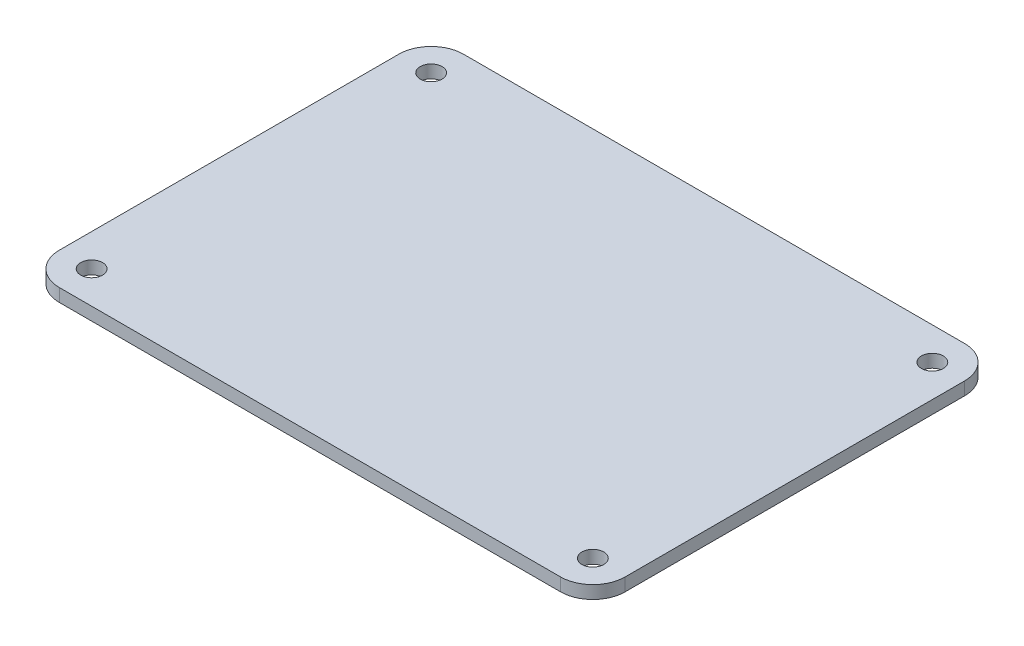
ISO-10303-21;
HEADER;
FILE_DESCRIPTION(('STEP AP214'),'2;1');
FILE_NAME('part.step','',(''),(''),'','','');
FILE_SCHEMA(('AUTOMOTIVE_DESIGN { 1 0 10303 214 1 1 1 1 }'));
ENDSEC;
DATA;
#1=APPLICATION_CONTEXT('core data for automotive mechanical design processes');
#2=APPLICATION_PROTOCOL_DEFINITION('international standard','automotive_design',2000,#1);
#3=PRODUCT_CONTEXT('',#1,'mechanical');
#4=PRODUCT('Part','Part','',(#3));
#5=PRODUCT_RELATED_PRODUCT_CATEGORY('part','',(#4));
#6=PRODUCT_DEFINITION_FORMATION('','',#4);
#7=PRODUCT_DEFINITION_CONTEXT('part definition',#1,'design');
#8=PRODUCT_DEFINITION('design','',#6,#7);
#9=PRODUCT_DEFINITION_SHAPE('','',#8);
#10=(LENGTH_UNIT() NAMED_UNIT(*) SI_UNIT(.MILLI.,.METRE.));
#11=(NAMED_UNIT(*) PLANE_ANGLE_UNIT() SI_UNIT($,.RADIAN.));
#12=(NAMED_UNIT(*) SI_UNIT($,.STERADIAN.) SOLID_ANGLE_UNIT());
#13=UNCERTAINTY_MEASURE_WITH_UNIT(LENGTH_MEASURE(1.E-05),#10,'distance_accuracy_value','');
#14=(GEOMETRIC_REPRESENTATION_CONTEXT(3) GLOBAL_UNCERTAINTY_ASSIGNED_CONTEXT((#13)) GLOBAL_UNIT_ASSIGNED_CONTEXT((#10,
#11,#12)) REPRESENTATION_CONTEXT('',''));
#15=CARTESIAN_POINT('',(0.,0.,0.));
#16=DIRECTION('',(0.,0.,1.));
#17=DIRECTION('',(1.,0.,0.));
#18=AXIS2_PLACEMENT_3D('',#15,#16,#17);
#19=CARTESIAN_POINT('',(35.,1.6,25.));
#20=DIRECTION('',(-1.,0.,0.));
#21=DIRECTION('',(0.,0.,1.));
#22=AXIS2_PLACEMENT_3D('',#19,#20,#21);
#23=PLANE('',#22);
#24=DIRECTION('',(0.,0.,-1.));
#25=VECTOR('',#24,1.);
#26=CARTESIAN_POINT('',(35.,0.,25.));
#27=LINE('',#26,#25);
#28=CARTESIAN_POINT('',(35.,0.,21.));
#29=VERTEX_POINT('',#28);
#30=CARTESIAN_POINT('',(35.,0.,-21.));
#31=VERTEX_POINT('',#30);
#32=EDGE_CURVE('E126',#29,#31,#27,.T.);
#33=ORIENTED_EDGE('',*,*,#32,.T.);
#34=DIRECTION('',(0.,-1.,0.));
#35=VECTOR('',#34,1.);
#36=CARTESIAN_POINT('',(35.,1.6,-21.));
#37=LINE('',#36,#35);
#38=CARTESIAN_POINT('',(35.,1.6,-21.));
#39=VERTEX_POINT('',#38);
#40=EDGE_CURVE('E104',#31,#39,#37,.F.);
#41=ORIENTED_EDGE('',*,*,#40,.T.);
#42=DIRECTION('',(0.,0.,-1.));
#43=VECTOR('',#42,1.);
#44=CARTESIAN_POINT('',(35.,1.6,25.));
#45=LINE('',#44,#43);
#46=CARTESIAN_POINT('',(35.,1.6,21.));
#47=VERTEX_POINT('',#46);
#48=EDGE_CURVE('E136',#47,#39,#45,.T.);
#49=ORIENTED_EDGE('',*,*,#48,.F.);
#50=DIRECTION('',(0.,-1.,0.));
#51=VECTOR('',#50,1.);
#52=CARTESIAN_POINT('',(35.,1.6,21.));
#53=LINE('',#52,#51);
#54=EDGE_CURVE('E109',#47,#29,#53,.T.);
#55=ORIENTED_EDGE('',*,*,#54,.T.);
#56=EDGE_LOOP('',(#33,#41,#49,#55));
#57=FACE_BOUND('',#56,.T.);
#58=ADVANCED_FACE('F33',(#57),#23,.F.);
#59=CARTESIAN_POINT('',(-35.,1.6,-25.));
#60=DIRECTION('',(0.,0.,1.));
#61=DIRECTION('',(1.,0.,0.));
#62=AXIS2_PLACEMENT_3D('',#59,#60,#61);
#63=PLANE('',#62);
#64=DIRECTION('',(-1.,0.,0.));
#65=VECTOR('',#64,1.);
#66=CARTESIAN_POINT('',(-35.,1.6,-25.));
#67=LINE('',#66,#65);
#68=CARTESIAN_POINT('',(31.,1.6,-25.));
#69=VERTEX_POINT('',#68);
#70=CARTESIAN_POINT('',(-31.,1.6,-25.));
#71=VERTEX_POINT('',#70);
#72=EDGE_CURVE('E119',#69,#71,#67,.T.);
#73=ORIENTED_EDGE('',*,*,#72,.F.);
#74=DIRECTION('',(0.,-1.,0.));
#75=VECTOR('',#74,1.);
#76=CARTESIAN_POINT('',(31.,1.6,-25.));
#77=LINE('',#76,#75);
#78=CARTESIAN_POINT('',(31.,0.,-25.));
#79=VERTEX_POINT('',#78);
#80=EDGE_CURVE('E103',#69,#79,#77,.T.);
#81=ORIENTED_EDGE('',*,*,#80,.T.);
#82=DIRECTION('',(-1.,0.,0.));
#83=VECTOR('',#82,1.);
#84=CARTESIAN_POINT('',(-35.,0.,-25.));
#85=LINE('',#84,#83);
#86=CARTESIAN_POINT('',(-31.,0.,-25.));
#87=VERTEX_POINT('',#86);
#88=EDGE_CURVE('E116',#79,#87,#85,.T.);
#89=ORIENTED_EDGE('',*,*,#88,.T.);
#90=DIRECTION('',(0.,-1.,0.));
#91=VECTOR('',#90,1.);
#92=CARTESIAN_POINT('',(-31.,1.6,-25.));
#93=LINE('',#92,#91);
#94=EDGE_CURVE('E121',#87,#71,#93,.F.);
#95=ORIENTED_EDGE('',*,*,#94,.T.);
#96=EDGE_LOOP('',(#73,#81,#89,#95));
#97=FACE_BOUND('',#96,.T.);
#98=ADVANCED_FACE('F115',(#97),#63,.F.);
#99=CARTESIAN_POINT('',(-35.,1.6,25.));
#100=DIRECTION('',(1.,0.,0.));
#101=DIRECTION('',(0.,0.,-1.));
#102=AXIS2_PLACEMENT_3D('',#99,#100,#101);
#103=PLANE('',#102);
#104=DIRECTION('',(0.,0.,1.));
#105=VECTOR('',#104,1.);
#106=CARTESIAN_POINT('',(-35.,0.,25.));
#107=LINE('',#106,#105);
#108=CARTESIAN_POINT('',(-35.,0.,-21.));
#109=VERTEX_POINT('',#108);
#110=CARTESIAN_POINT('',(-35.,0.,21.));
#111=VERTEX_POINT('',#110);
#112=EDGE_CURVE('E125',#109,#111,#107,.T.);
#113=ORIENTED_EDGE('',*,*,#112,.T.);
#114=DIRECTION('',(0.,-1.,0.));
#115=VECTOR('',#114,1.);
#116=CARTESIAN_POINT('',(-35.,1.6,21.));
#117=LINE('',#116,#115);
#118=CARTESIAN_POINT('',(-35.,1.6,21.));
#119=VERTEX_POINT('',#118);
#120=EDGE_CURVE('E11',#111,#119,#117,.F.);
#121=ORIENTED_EDGE('',*,*,#120,.T.);
#122=DIRECTION('',(0.,0.,1.));
#123=VECTOR('',#122,1.);
#124=CARTESIAN_POINT('',(-35.,1.6,25.));
#125=LINE('',#124,#123);
#126=CARTESIAN_POINT('',(-35.,1.6,-21.));
#127=VERTEX_POINT('',#126);
#128=EDGE_CURVE('E162',#127,#119,#125,.T.);
#129=ORIENTED_EDGE('',*,*,#128,.F.);
#130=DIRECTION('',(0.,-1.,0.));
#131=VECTOR('',#130,1.);
#132=CARTESIAN_POINT('',(-35.,1.6,-21.));
#133=LINE('',#132,#131);
#134=EDGE_CURVE('E41',#127,#109,#133,.T.);
#135=ORIENTED_EDGE('',*,*,#134,.T.);
#136=EDGE_LOOP('',(#113,#121,#129,#135));
#137=FACE_BOUND('',#136,.T.);
#138=ADVANCED_FACE('F160',(#137),#103,.F.);
#139=CARTESIAN_POINT('',(-35.,1.6,25.));
#140=DIRECTION('',(0.,0.,-1.));
#141=DIRECTION('',(-1.,0.,0.));
#142=AXIS2_PLACEMENT_3D('',#139,#140,#141);
#143=PLANE('',#142);
#144=DIRECTION('',(1.,0.,0.));
#145=VECTOR('',#144,1.);
#146=CARTESIAN_POINT('',(-35.,0.,25.));
#147=LINE('',#146,#145);
#148=CARTESIAN_POINT('',(-31.,0.,25.));
#149=VERTEX_POINT('',#148);
#150=CARTESIAN_POINT('',(31.,0.,25.));
#151=VERTEX_POINT('',#150);
#152=EDGE_CURVE('E129',#149,#151,#147,.T.);
#153=ORIENTED_EDGE('',*,*,#152,.T.);
#154=DIRECTION('',(0.,-1.,0.));
#155=VECTOR('',#154,1.);
#156=CARTESIAN_POINT('',(31.,1.6,25.));
#157=LINE('',#156,#155);
#158=CARTESIAN_POINT('',(31.,1.6,25.));
#159=VERTEX_POINT('',#158);
#160=EDGE_CURVE('E48',#151,#159,#157,.F.);
#161=ORIENTED_EDGE('',*,*,#160,.T.);
#162=DIRECTION('',(1.,0.,0.));
#163=VECTOR('',#162,1.);
#164=CARTESIAN_POINT('',(-35.,1.6,25.));
#165=LINE('',#164,#163);
#166=CARTESIAN_POINT('',(-31.,1.6,25.));
#167=VERTEX_POINT('',#166);
#168=EDGE_CURVE('E137',#167,#159,#165,.T.);
#169=ORIENTED_EDGE('',*,*,#168,.F.);
#170=DIRECTION('',(0.,-1.,0.));
#171=VECTOR('',#170,1.);
#172=CARTESIAN_POINT('',(-31.,1.6,25.));
#173=LINE('',#172,#171);
#174=EDGE_CURVE('E153',#167,#149,#173,.T.);
#175=ORIENTED_EDGE('',*,*,#174,.T.);
#176=EDGE_LOOP('',(#153,#161,#169,#175));
#177=FACE_BOUND('',#176,.T.);
#178=ADVANCED_FACE('F169',(#177),#143,.F.);
#179=CARTESIAN_POINT('',(0.,1.6,0.));
#180=DIRECTION('',(0.,-1.,0.));
#181=DIRECTION('',(0.,0.,-1.));
#182=AXIS2_PLACEMENT_3D('',#179,#180,#181);
#183=PLANE('',#182);
#184=CARTESIAN_POINT('',(-31.,1.6,21.));
#185=DIRECTION('',(0.,1.,0.));
#186=DIRECTION('',(0.,0.,1.));
#187=AXIS2_PLACEMENT_3D('',#184,#185,#186);
#188=CIRCLE('',#187,1.35);
#189=CARTESIAN_POINT('',(-31.,1.6,22.35));
#190=VERTEX_POINT('',#189);
#191=EDGE_CURVE('E182',#190,#190,#188,.T.);
#192=ORIENTED_EDGE('',*,*,#191,.F.);
#193=EDGE_LOOP('',(#192));
#194=FACE_BOUND('',#193,.T.);
#195=CARTESIAN_POINT('',(31.,1.6,21.));
#196=DIRECTION('',(0.,1.,0.));
#197=DIRECTION('',(0.,0.,1.));
#198=AXIS2_PLACEMENT_3D('',#195,#196,#197);
#199=CIRCLE('',#198,1.35);
#200=CARTESIAN_POINT('',(31.,1.6,22.35));
#201=VERTEX_POINT('',#200);
#202=EDGE_CURVE('E188',#201,#201,#199,.T.);
#203=ORIENTED_EDGE('',*,*,#202,.F.);
#204=EDGE_LOOP('',(#203));
#205=FACE_BOUND('',#204,.T.);
#206=CARTESIAN_POINT('',(31.,1.6,-21.));
#207=DIRECTION('',(0.,1.,0.));
#208=DIRECTION('',(0.,0.,1.));
#209=AXIS2_PLACEMENT_3D('',#206,#207,#208);
#210=CIRCLE('',#209,1.35);
#211=CARTESIAN_POINT('',(31.,1.6,-19.65));
#212=VERTEX_POINT('',#211);
#213=EDGE_CURVE('E194',#212,#212,#210,.T.);
#214=ORIENTED_EDGE('',*,*,#213,.F.);
#215=EDGE_LOOP('',(#214));
#216=FACE_BOUND('',#215,.T.);
#217=CARTESIAN_POINT('',(-31.,1.6,-21.));
#218=DIRECTION('',(0.,1.,0.));
#219=DIRECTION('',(0.,0.,1.));
#220=AXIS2_PLACEMENT_3D('',#217,#218,#219);
#221=CIRCLE('',#220,1.35);
#222=CARTESIAN_POINT('',(-31.,1.6,-19.65));
#223=VERTEX_POINT('',#222);
#224=EDGE_CURVE('E176',#223,#223,#221,.T.);
#225=ORIENTED_EDGE('',*,*,#224,.F.);
#226=EDGE_LOOP('',(#225));
#227=FACE_BOUND('',#226,.T.);
#228=ORIENTED_EDGE('',*,*,#48,.T.);
#229=CARTESIAN_POINT('',(31.,1.6,-21.));
#230=DIRECTION('',(0.,-1.,0.));
#231=DIRECTION('',(0.,0.,-1.));
#232=AXIS2_PLACEMENT_3D('',#229,#230,#231);
#233=CIRCLE('',#232,4.);
#234=EDGE_CURVE('E151',#39,#69,#233,.F.);
#235=ORIENTED_EDGE('',*,*,#234,.T.);
#236=ORIENTED_EDGE('',*,*,#72,.T.);
#237=CARTESIAN_POINT('',(-31.,1.6,-21.));
#238=DIRECTION('',(0.,-1.,0.));
#239=DIRECTION('',(0.,0.,-1.));
#240=AXIS2_PLACEMENT_3D('',#237,#238,#239);
#241=CIRCLE('',#240,4.);
#242=EDGE_CURVE('E146',#71,#127,#241,.F.);
#243=ORIENTED_EDGE('',*,*,#242,.T.);
#244=ORIENTED_EDGE('',*,*,#128,.T.);
#245=CARTESIAN_POINT('',(-31.,1.6,21.));
#246=DIRECTION('',(0.,-1.,0.));
#247=DIRECTION('',(0.,0.,-1.));
#248=AXIS2_PLACEMENT_3D('',#245,#246,#247);
#249=CIRCLE('',#248,4.);
#250=EDGE_CURVE('E55',#119,#167,#249,.F.);
#251=ORIENTED_EDGE('',*,*,#250,.T.);
#252=ORIENTED_EDGE('',*,*,#168,.T.);
#253=CARTESIAN_POINT('',(31.,1.6,21.));
#254=DIRECTION('',(0.,-1.,0.));
#255=DIRECTION('',(0.,0.,-1.));
#256=AXIS2_PLACEMENT_3D('',#253,#254,#255);
#257=CIRCLE('',#256,4.);
#258=EDGE_CURVE('E149',#159,#47,#257,.F.);
#259=ORIENTED_EDGE('',*,*,#258,.T.);
#260=EDGE_LOOP('',(#228,#235,#236,#243,#244,#251,#252,#259));
#261=FACE_BOUND('',#260,.T.);
#262=ADVANCED_FACE('F210',(#194,#205,#216,#227,#261),#183,.F.);
#263=CARTESIAN_POINT('',(0.,0.,0.));
#264=DIRECTION('',(0.,-1.,0.));
#265=DIRECTION('',(0.,0.,-1.));
#266=AXIS2_PLACEMENT_3D('',#263,#264,#265);
#267=PLANE('',#266);
#268=CARTESIAN_POINT('',(-31.,0.,21.));
#269=DIRECTION('',(0.,1.,0.));
#270=DIRECTION('',(0.,0.,1.));
#271=AXIS2_PLACEMENT_3D('',#268,#269,#270);
#272=CIRCLE('',#271,1.35);
#273=CARTESIAN_POINT('',(-31.,0.,22.35));
#274=VERTEX_POINT('',#273);
#275=EDGE_CURVE('E185',#274,#274,#272,.T.);
#276=ORIENTED_EDGE('',*,*,#275,.T.);
#277=EDGE_LOOP('',(#276));
#278=FACE_BOUND('',#277,.T.);
#279=CARTESIAN_POINT('',(31.,0.,21.));
#280=DIRECTION('',(0.,1.,0.));
#281=DIRECTION('',(0.,0.,1.));
#282=AXIS2_PLACEMENT_3D('',#279,#280,#281);
#283=CIRCLE('',#282,1.35);
#284=CARTESIAN_POINT('',(31.,0.,22.35));
#285=VERTEX_POINT('',#284);
#286=EDGE_CURVE('E191',#285,#285,#283,.T.);
#287=ORIENTED_EDGE('',*,*,#286,.T.);
#288=EDGE_LOOP('',(#287));
#289=FACE_BOUND('',#288,.T.);
#290=CARTESIAN_POINT('',(31.,0.,-21.));
#291=DIRECTION('',(0.,1.,0.));
#292=DIRECTION('',(0.,0.,1.));
#293=AXIS2_PLACEMENT_3D('',#290,#291,#292);
#294=CIRCLE('',#293,1.35);
#295=CARTESIAN_POINT('',(31.,0.,-19.65));
#296=VERTEX_POINT('',#295);
#297=EDGE_CURVE('E179',#296,#296,#294,.T.);
#298=ORIENTED_EDGE('',*,*,#297,.T.);
#299=EDGE_LOOP('',(#298));
#300=FACE_BOUND('',#299,.T.);
#301=CARTESIAN_POINT('',(-31.,0.,-21.));
#302=DIRECTION('',(0.,1.,0.));
#303=DIRECTION('',(0.,0.,1.));
#304=AXIS2_PLACEMENT_3D('',#301,#302,#303);
#305=CIRCLE('',#304,1.35);
#306=CARTESIAN_POINT('',(-31.,0.,-19.65));
#307=VERTEX_POINT('',#306);
#308=EDGE_CURVE('E131',#307,#307,#305,.T.);
#309=ORIENTED_EDGE('',*,*,#308,.T.);
#310=EDGE_LOOP('',(#309));
#311=FACE_BOUND('',#310,.T.);
#312=ORIENTED_EDGE('',*,*,#88,.F.);
#313=CARTESIAN_POINT('',(31.,0.,-21.));
#314=DIRECTION('',(0.,-1.,0.));
#315=DIRECTION('',(0.,0.,-1.));
#316=AXIS2_PLACEMENT_3D('',#313,#314,#315);
#317=CIRCLE('',#316,4.);
#318=EDGE_CURVE('E99',#79,#31,#317,.T.);
#319=ORIENTED_EDGE('',*,*,#318,.T.);
#320=ORIENTED_EDGE('',*,*,#32,.F.);
#321=CARTESIAN_POINT('',(31.,0.,21.));
#322=DIRECTION('',(0.,-1.,0.));
#323=DIRECTION('',(0.,0.,-1.));
#324=AXIS2_PLACEMENT_3D('',#321,#322,#323);
#325=CIRCLE('',#324,4.);
#326=EDGE_CURVE('E110',#29,#151,#325,.T.);
#327=ORIENTED_EDGE('',*,*,#326,.T.);
#328=ORIENTED_EDGE('',*,*,#152,.F.);
#329=CARTESIAN_POINT('',(-31.,0.,21.));
#330=DIRECTION('',(0.,-1.,0.));
#331=DIRECTION('',(0.,0.,-1.));
#332=AXIS2_PLACEMENT_3D('',#329,#330,#331);
#333=CIRCLE('',#332,4.);
#334=EDGE_CURVE('E140',#149,#111,#333,.T.);
#335=ORIENTED_EDGE('',*,*,#334,.T.);
#336=ORIENTED_EDGE('',*,*,#112,.F.);
#337=CARTESIAN_POINT('',(-31.,0.,-21.));
#338=DIRECTION('',(0.,-1.,0.));
#339=DIRECTION('',(0.,0.,-1.));
#340=AXIS2_PLACEMENT_3D('',#337,#338,#339);
#341=CIRCLE('',#340,4.);
#342=EDGE_CURVE('E120',#109,#87,#341,.T.);
#343=ORIENTED_EDGE('',*,*,#342,.T.);
#344=EDGE_LOOP('',(#312,#319,#320,#327,#328,#335,#336,#343));
#345=FACE_BOUND('',#344,.T.);
#346=ADVANCED_FACE('F123',(#278,#289,#300,#311,#345),#267,.T.);
#347=CARTESIAN_POINT('',(-31.,0.,-21.));
#348=DIRECTION('',(0.,1.,0.));
#349=DIRECTION('',(0.,0.,1.));
#350=AXIS2_PLACEMENT_3D('',#347,#348,#349);
#351=CYLINDRICAL_SURFACE('',#350,1.35);
#352=ORIENTED_EDGE('',*,*,#308,.F.);
#353=EDGE_LOOP('',(#352));
#354=FACE_BOUND('',#353,.T.);
#355=ORIENTED_EDGE('',*,*,#224,.T.);
#356=EDGE_LOOP('',(#355));
#357=FACE_BOUND('',#356,.T.);
#358=ADVANCED_FACE('F206',(#354,#357),#351,.F.);
#359=CARTESIAN_POINT('',(31.,0.,-21.));
#360=DIRECTION('',(0.,1.,0.));
#361=DIRECTION('',(0.,0.,1.));
#362=AXIS2_PLACEMENT_3D('',#359,#360,#361);
#363=CYLINDRICAL_SURFACE('',#362,1.35);
#364=ORIENTED_EDGE('',*,*,#297,.F.);
#365=EDGE_LOOP('',(#364));
#366=FACE_BOUND('',#365,.T.);
#367=ORIENTED_EDGE('',*,*,#213,.T.);
#368=EDGE_LOOP('',(#367));
#369=FACE_BOUND('',#368,.T.);
#370=ADVANCED_FACE('F202',(#366,#369),#363,.F.);
#371=CARTESIAN_POINT('',(31.,0.,21.));
#372=DIRECTION('',(0.,1.,0.));
#373=DIRECTION('',(0.,0.,1.));
#374=AXIS2_PLACEMENT_3D('',#371,#372,#373);
#375=CYLINDRICAL_SURFACE('',#374,1.35);
#376=ORIENTED_EDGE('',*,*,#286,.F.);
#377=EDGE_LOOP('',(#376));
#378=FACE_BOUND('',#377,.T.);
#379=ORIENTED_EDGE('',*,*,#202,.T.);
#380=EDGE_LOOP('',(#379));
#381=FACE_BOUND('',#380,.T.);
#382=ADVANCED_FACE('F205',(#378,#381),#375,.F.);
#383=CARTESIAN_POINT('',(-31.,0.,21.));
#384=DIRECTION('',(0.,1.,0.));
#385=DIRECTION('',(0.,0.,1.));
#386=AXIS2_PLACEMENT_3D('',#383,#384,#385);
#387=CYLINDRICAL_SURFACE('',#386,1.35);
#388=ORIENTED_EDGE('',*,*,#275,.F.);
#389=EDGE_LOOP('',(#388));
#390=FACE_BOUND('',#389,.T.);
#391=ORIENTED_EDGE('',*,*,#191,.T.);
#392=EDGE_LOOP('',(#391));
#393=FACE_BOUND('',#392,.T.);
#394=ADVANCED_FACE('F227',(#390,#393),#387,.F.);
#395=CARTESIAN_POINT('',(31.,1.6,-21.));
#396=DIRECTION('',(0.,-1.,0.));
#397=DIRECTION('',(0.,0.,-1.));
#398=AXIS2_PLACEMENT_3D('',#395,#396,#397);
#399=CYLINDRICAL_SURFACE('',#398,4.);
#400=ORIENTED_EDGE('',*,*,#234,.F.);
#401=ORIENTED_EDGE('',*,*,#40,.F.);
#402=ORIENTED_EDGE('',*,*,#318,.F.);
#403=ORIENTED_EDGE('',*,*,#80,.F.);
#404=EDGE_LOOP('',(#400,#401,#402,#403));
#405=FACE_BOUND('',#404,.T.);
#406=ADVANCED_FACE('F102',(#405),#399,.T.);
#407=CARTESIAN_POINT('',(31.,1.6,21.));
#408=DIRECTION('',(0.,-1.,0.));
#409=DIRECTION('',(0.,0.,-1.));
#410=AXIS2_PLACEMENT_3D('',#407,#408,#409);
#411=CYLINDRICAL_SURFACE('',#410,4.);
#412=ORIENTED_EDGE('',*,*,#258,.F.);
#413=ORIENTED_EDGE('',*,*,#160,.F.);
#414=ORIENTED_EDGE('',*,*,#326,.F.);
#415=ORIENTED_EDGE('',*,*,#54,.F.);
#416=EDGE_LOOP('',(#412,#413,#414,#415));
#417=FACE_BOUND('',#416,.T.);
#418=ADVANCED_FACE('F220',(#417),#411,.T.);
#419=CARTESIAN_POINT('',(-31.,1.6,21.));
#420=DIRECTION('',(0.,-1.,0.));
#421=DIRECTION('',(0.,0.,-1.));
#422=AXIS2_PLACEMENT_3D('',#419,#420,#421);
#423=CYLINDRICAL_SURFACE('',#422,4.);
#424=ORIENTED_EDGE('',*,*,#250,.F.);
#425=ORIENTED_EDGE('',*,*,#120,.F.);
#426=ORIENTED_EDGE('',*,*,#334,.F.);
#427=ORIENTED_EDGE('',*,*,#174,.F.);
#428=EDGE_LOOP('',(#424,#425,#426,#427));
#429=FACE_BOUND('',#428,.T.);
#430=ADVANCED_FACE('F168',(#429),#423,.T.);
#431=CARTESIAN_POINT('',(-31.,1.6,-21.));
#432=DIRECTION('',(0.,-1.,0.));
#433=DIRECTION('',(0.,0.,-1.));
#434=AXIS2_PLACEMENT_3D('',#431,#432,#433);
#435=CYLINDRICAL_SURFACE('',#434,4.);
#436=ORIENTED_EDGE('',*,*,#242,.F.);
#437=ORIENTED_EDGE('',*,*,#94,.F.);
#438=ORIENTED_EDGE('',*,*,#342,.F.);
#439=ORIENTED_EDGE('',*,*,#134,.F.);
#440=EDGE_LOOP('',(#436,#437,#438,#439));
#441=FACE_BOUND('',#440,.T.);
#442=ADVANCED_FACE('F35',(#441),#435,.T.);
#443=CLOSED_SHELL('',(#58,#98,#138,#178,#262,#346,#358,#370,#382,#394,#406,#418,#430,#442));
#444=MANIFOLD_SOLID_BREP('B2',#443);
#445=ADVANCED_BREP_SHAPE_REPRESENTATION('',(#18,#444),#14);
#446=SHAPE_DEFINITION_REPRESENTATION(#9,#445);
ENDSEC;
END-ISO-10303-21;
